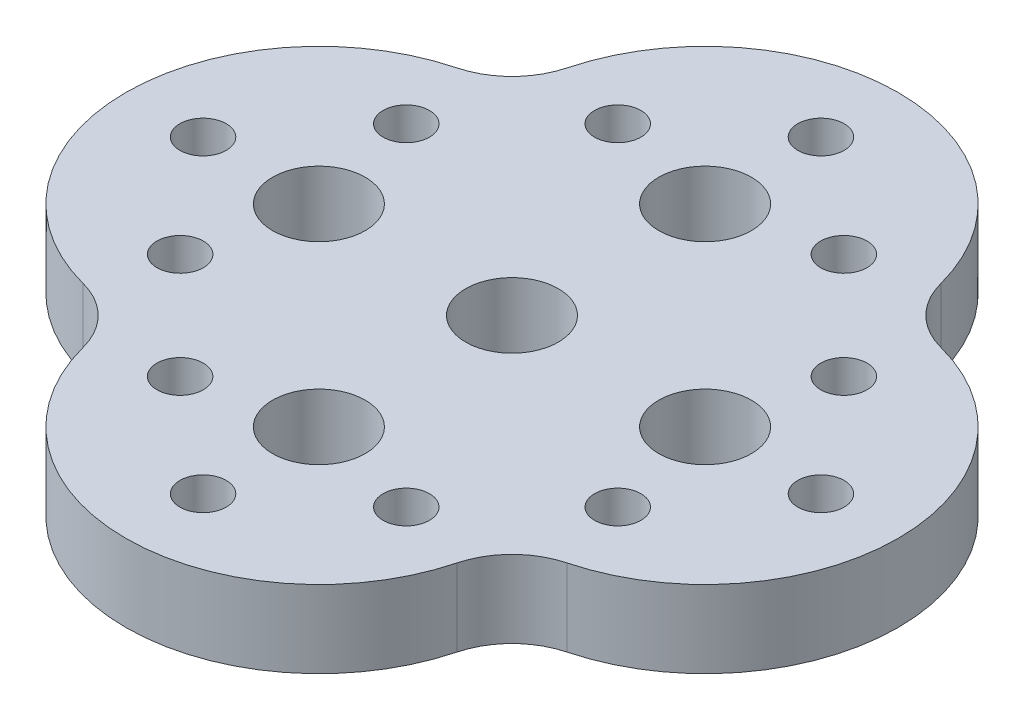
ISO-10303-21;
HEADER;
FILE_DESCRIPTION(('STEP AP214'),'2;1');
FILE_NAME('part.step','',(''),(''),'','','');
FILE_SCHEMA(('AUTOMOTIVE_DESIGN { 1 0 10303 214 1 1 1 1 }'));
ENDSEC;
DATA;
#1=APPLICATION_CONTEXT('core data for automotive mechanical design processes');
#2=APPLICATION_PROTOCOL_DEFINITION('international standard','automotive_design',2000,#1);
#3=PRODUCT_CONTEXT('',#1,'mechanical');
#4=PRODUCT('Part','Part','',(#3));
#5=PRODUCT_RELATED_PRODUCT_CATEGORY('part','',(#4));
#6=PRODUCT_DEFINITION_FORMATION('','',#4);
#7=PRODUCT_DEFINITION_CONTEXT('part definition',#1,'design');
#8=PRODUCT_DEFINITION('design','',#6,#7);
#9=PRODUCT_DEFINITION_SHAPE('','',#8);
#10=(LENGTH_UNIT() NAMED_UNIT(*) SI_UNIT(.MILLI.,.METRE.));
#11=(NAMED_UNIT(*) PLANE_ANGLE_UNIT() SI_UNIT($,.RADIAN.));
#12=(NAMED_UNIT(*) SI_UNIT($,.STERADIAN.) SOLID_ANGLE_UNIT());
#13=UNCERTAINTY_MEASURE_WITH_UNIT(LENGTH_MEASURE(1.E-05),#10,'distance_accuracy_value','');
#14=(GEOMETRIC_REPRESENTATION_CONTEXT(3) GLOBAL_UNCERTAINTY_ASSIGNED_CONTEXT((#13)) GLOBAL_UNIT_ASSIGNED_CONTEXT((#10,
#11,#12)) REPRESENTATION_CONTEXT('',''));
#15=CARTESIAN_POINT('',(0.,0.,0.));
#16=DIRECTION('',(0.,0.,1.));
#17=DIRECTION('',(1.,0.,0.));
#18=AXIS2_PLACEMENT_3D('',#15,#16,#17);
#19=CARTESIAN_POINT('',(429.653560967614,254.,747.116705177323));
#20=DIRECTION('',(0.,1.,0.));
#21=DIRECTION('',(0.,0.,1.));
#22=AXIS2_PLACEMENT_3D('',#19,#20,#21);
#23=PLANE('',#22);
#24=CARTESIAN_POINT('',(719.193799483631,254.000000000002,371.449474263436));
#25=DIRECTION('',(0.,1.,0.));
#26=DIRECTION('',(0.276539134643967,0.,0.961002657129712));
#27=AXIS2_PLACEMENT_3D('',#24,#25,#26);
#28=CIRCLE('',#27,76.2);
#29=CARTESIAN_POINT('',(740.266081543502,254.000000000002,444.67787673672));
#30=VERTEX_POINT('',#29);
#31=EDGE_CURVE('E354',#30,#30,#28,.T.);
#32=ORIENTED_EDGE('',*,*,#31,.F.);
#33=EDGE_LOOP('',(#32));
#34=FACE_BOUND('',#33,.T.);
#35=CARTESIAN_POINT('',(1015.63144205464,254.000000000002,-0.405413748390896));
#36=DIRECTION('',(0.,1.,0.));
#37=DIRECTION('',(1.,0.,-1.85470023735373E-12));
#38=AXIS2_PLACEMENT_3D('',#35,#36,#37);
#39=CIRCLE('',#38,76.2);
#40=CARTESIAN_POINT('',(1091.83144205464,254.000000000003,-0.405413748532224));
#41=VERTEX_POINT('',#40);
#42=EDGE_CURVE('E346',#41,#41,#39,.T.);
#43=ORIENTED_EDGE('',*,*,#42,.F.);
#44=EDGE_LOOP('',(#43));
#45=FACE_BOUND('',#44,.T.);
#46=CARTESIAN_POINT('',(719.193799482217,254.000000000002,-372.260301759018));
#47=DIRECTION('',(0.,1.,0.));
#48=DIRECTION('',(0.27653913463313,0.,-0.96100265713283));
#49=AXIS2_PLACEMENT_3D('',#46,#47,#48);
#50=CIRCLE('',#49,76.2);
#51=CARTESIAN_POINT('',(740.266081541261,254.000000000003,-445.488704232539));
#52=VERTEX_POINT('',#51);
#53=EDGE_CURVE('E338',#52,#52,#50,.T.);
#54=ORIENTED_EDGE('',*,*,#53,.F.);
#55=EDGE_LOOP('',(#54));
#56=FACE_BOUND('',#55,.T.);
#57=CARTESIAN_POINT('',(371.486330054716,254.000000000002,-719.967771172362));
#58=DIRECTION('',(0.,1.,0.));
#59=DIRECTION('',(0.961002657121579,0.,-0.276539134672229));
#60=AXIS2_PLACEMENT_3D('',#57,#58,#59);
#61=CIRCLE('',#60,76.2);
#62=CARTESIAN_POINT('',(444.714732527381,254.000000000003,-741.040053234386));
#63=VERTEX_POINT('',#62);
#64=EDGE_CURVE('E330',#63,#63,#61,.T.);
#65=ORIENTED_EDGE('',*,*,#64,.F.);
#66=EDGE_LOOP('',(#65));
#67=FACE_BOUND('',#66,.T.);
#68=CARTESIAN_POINT('',(-0.368557952435466,254.000000000002,-1016.40541374768));
#69=DIRECTION('',(0.,1.,0.));
#70=DIRECTION('',(0.,0.,-1.));
#71=AXIS2_PLACEMENT_3D('',#68,#69,#70);
#72=CIRCLE('',#71,76.2);
#73=CARTESIAN_POINT('',(-0.368557952434393,254.000000000003,-1092.60541374768));
#74=VERTEX_POINT('',#73);
#75=EDGE_CURVE('E322',#74,#74,#72,.T.);
#76=ORIENTED_EDGE('',*,*,#75,.F.);
#77=EDGE_LOOP('',(#76));
#78=FACE_BOUND('',#77,.T.);
#79=CARTESIAN_POINT('',(-372.223445959588,254.000000000002,-719.967771172363));
#80=DIRECTION('',(0.,1.,0.));
#81=DIRECTION('',(-0.961002657121577,0.,-0.276539134672236));
#82=AXIS2_PLACEMENT_3D('',#79,#80,#81);
#83=CIRCLE('',#82,76.2);
#84=CARTESIAN_POINT('',(-445.451848432252,254.000000000003,-741.040053234388));
#85=VERTEX_POINT('',#84);
#86=EDGE_CURVE('E314',#85,#85,#83,.T.);
#87=ORIENTED_EDGE('',*,*,#86,.F.);
#88=EDGE_LOOP('',(#87));
#89=FACE_BOUND('',#88,.T.);
#90=CARTESIAN_POINT('',(-719.930915387087,254.000000000002,-372.260301759017));
#91=DIRECTION('',(0.,1.,0.));
#92=DIRECTION('',(-0.276539134633121,0.,-0.961002657132833));
#93=AXIS2_PLACEMENT_3D('',#90,#91,#92);
#94=CIRCLE('',#93,76.2);
#95=CARTESIAN_POINT('',(-741.003197446131,254.000000000003,-445.488704232539));
#96=VERTEX_POINT('',#95);
#97=EDGE_CURVE('E306',#96,#96,#94,.T.);
#98=ORIENTED_EDGE('',*,*,#97,.F.);
#99=EDGE_LOOP('',(#98));
#100=FACE_BOUND('',#99,.T.);
#101=CARTESIAN_POINT('',(-1016.36855795951,254.000000000002,-0.405413748391502));
#102=DIRECTION('',(0.,1.,0.));
#103=DIRECTION('',(-1.,0.,-1.86800002889433E-12));
#104=AXIS2_PLACEMENT_3D('',#101,#102,#103);
#105=CIRCLE('',#104,76.2);
#106=CARTESIAN_POINT('',(-1092.56855795951,254.000000000003,-0.405413748533843));
#107=VERTEX_POINT('',#106);
#108=EDGE_CURVE('E297',#107,#107,#105,.T.);
#109=ORIENTED_EDGE('',*,*,#108,.F.);
#110=EDGE_LOOP('',(#109));
#111=FACE_BOUND('',#110,.T.);
#112=CARTESIAN_POINT('',(-719.930915388502,254.000000000002,371.449474263436));
#113=DIRECTION('',(0.,1.,0.));
#114=DIRECTION('',(-0.276539134643981,0.,0.961002657129708));
#115=AXIS2_PLACEMENT_3D('',#112,#113,#114);
#116=CIRCLE('',#115,76.2);
#117=CARTESIAN_POINT('',(-741.003197448373,254.000000000002,444.67787673672));
#118=VERTEX_POINT('',#117);
#119=EDGE_CURVE('E369',#118,#118,#116,.T.);
#120=ORIENTED_EDGE('',*,*,#119,.F.);
#121=EDGE_LOOP('',(#120));
#122=FACE_BOUND('',#121,.T.);
#123=CARTESIAN_POINT('',(-372.223445959759,254.000000000002,719.156943677051));
#124=DIRECTION('',(0.,1.,0.));
#125=DIRECTION('',(-0.961002657117675,0.,0.276539134685794));
#126=AXIS2_PLACEMENT_3D('',#123,#124,#125);
#127=CIRCLE('',#126,76.2);
#128=CARTESIAN_POINT('',(-445.451848432126,254.000000000003,740.229225740108));
#129=VERTEX_POINT('',#128);
#130=EDGE_CURVE('E361',#129,#129,#127,.T.);
#131=ORIENTED_EDGE('',*,*,#130,.F.);
#132=EDGE_LOOP('',(#131));
#133=FACE_BOUND('',#132,.T.);
#134=CARTESIAN_POINT('',(371.486330054887,254.000000000002,719.156943677051));
#135=DIRECTION('',(0.,1.,0.));
#136=DIRECTION('',(0.961002657117672,0.,0.276539134685807));
#137=AXIS2_PLACEMENT_3D('',#134,#135,#136);
#138=CIRCLE('',#137,76.2);
#139=CARTESIAN_POINT('',(444.714732527254,254.000000000003,740.22922574011));
#140=VERTEX_POINT('',#139);
#141=EDGE_CURVE('E289',#140,#140,#138,.T.);
#142=ORIENTED_EDGE('',*,*,#141,.F.);
#143=EDGE_LOOP('',(#142));
#144=FACE_BOUND('',#143,.T.);
#145=CARTESIAN_POINT('',(-0.36855795243626,254.,1015.59458625232));
#146=DIRECTION('',(0.,1.,0.));
#147=DIRECTION('',(0.,0.,1.));
#148=AXIS2_PLACEMENT_3D('',#145,#146,#147);
#149=CIRCLE('',#148,76.2);
#150=CARTESIAN_POINT('',(-0.36855795243626,254.,1091.79458625232));
#151=VERTEX_POINT('',#150);
#152=EDGE_CURVE('E281',#151,#151,#149,.T.);
#153=ORIENTED_EDGE('',*,*,#152,.F.);
#154=EDGE_LOOP('',(#153));
#155=FACE_BOUND('',#154,.T.);
#156=CARTESIAN_POINT('',(-0.368557952435851,254.,634.59458625232));
#157=DIRECTION('',(0.,1.,0.));
#158=DIRECTION('',(0.,0.,1.));
#159=AXIS2_PLACEMENT_3D('',#156,#157,#158);
#160=CIRCLE('',#159,152.4);
#161=CARTESIAN_POINT('',(-0.368557952435851,254.,786.99458625232));
#162=VERTEX_POINT('',#161);
#163=EDGE_CURVE('E261',#162,#162,#160,.T.);
#164=ORIENTED_EDGE('',*,*,#163,.F.);
#165=EDGE_LOOP('',(#164));
#166=FACE_BOUND('',#165,.T.);
#167=CARTESIAN_POINT('',(-0.368557952435851,254.,-635.405413747679));
#168=DIRECTION('',(0.,1.,0.));
#169=DIRECTION('',(0.,0.,1.));
#170=AXIS2_PLACEMENT_3D('',#167,#168,#169);
#171=CIRCLE('',#170,152.4);
#172=CARTESIAN_POINT('',(-0.368557952435851,254.,-483.005413747679));
#173=VERTEX_POINT('',#172);
#174=EDGE_CURVE('E245',#173,#173,#171,.T.);
#175=ORIENTED_EDGE('',*,*,#174,.F.);
#176=EDGE_LOOP('',(#175));
#177=FACE_BOUND('',#176,.T.);
#178=CARTESIAN_POINT('',(859.675679887664,254.,859.638824102326));
#179=DIRECTION('',(0.,-1.,0.));
#180=DIRECTION('',(0.,0.,1.));
#181=AXIS2_PLACEMENT_3D('',#178,#179,#180);
#182=CIRCLE('',#181,254.000000017688);
#183=CARTESIAN_POINT('',(613.94875477827,254.,795.340470427697));
#184=VERTEX_POINT('',#183);
#185=CARTESIAN_POINT('',(795.377326216378,254.,613.911898992058));
#186=VERTEX_POINT('',#185);
#187=EDGE_CURVE('E196',#184,#186,#182,.T.);
#188=ORIENTED_EDGE('',*,*,#187,.T.);
#189=CARTESIAN_POINT('',(634.631442047564,254.,-0.405413747679431));
#190=DIRECTION('',(0.,1.,0.));
#191=DIRECTION('',(0.,0.,1.));
#192=AXIS2_PLACEMENT_3D('',#189,#190,#191);
#193=CIRCLE('',#192,635.000000007075);
#194=CARTESIAN_POINT('',(795.377326211212,254.,-614.722726488768));
#195=VERTEX_POINT('',#194);
#196=EDGE_CURVE('E132',#186,#195,#193,.T.);
#197=ORIENTED_EDGE('',*,*,#196,.T.);
#198=CARTESIAN_POINT('',(859.675679877199,254.,-860.449651587219));
#199=DIRECTION('',(0.,-1.,0.));
#200=DIRECTION('',(0.,0.,1.));
#201=AXIS2_PLACEMENT_3D('',#198,#199,#200);
#202=CIRCLE('',#201,254.000000004914);
#203=CARTESIAN_POINT('',(613.948754779622,254.,-796.151297917891));
#204=VERTEX_POINT('',#203);
#205=EDGE_CURVE('E217',#195,#204,#202,.T.);
#206=ORIENTED_EDGE('',*,*,#205,.T.);
#207=CARTESIAN_POINT('',(-0.368557952435851,254.,-635.405413747679));
#208=DIRECTION('',(0.,1.,0.));
#209=DIRECTION('',(0.,0.,1.));
#210=AXIS2_PLACEMENT_3D('',#207,#208,#209);
#211=CIRCLE('',#210,635.);
#212=CARTESIAN_POINT('',(-614.685870684494,254.,-796.15129791789));
#213=VERTEX_POINT('',#212);
#214=EDGE_CURVE('E231',#204,#213,#211,.T.);
#215=ORIENTED_EDGE('',*,*,#214,.T.);
#216=CARTESIAN_POINT('',(-860.412795782071,254.,-860.449651587218));
#217=DIRECTION('',(0.,-1.,0.));
#218=DIRECTION('',(0.,0.,-1.));
#219=AXIS2_PLACEMENT_3D('',#216,#217,#218);
#220=CIRCLE('',#219,254.000000004914);
#221=CARTESIAN_POINT('',(-796.114442116084,254.,-614.722726488767));
#222=VERTEX_POINT('',#221);
#223=EDGE_CURVE('E151',#213,#222,#220,.T.);
#224=ORIENTED_EDGE('',*,*,#223,.T.);
#225=CARTESIAN_POINT('',(-635.368557952436,254.,-0.405413747679431));
#226=DIRECTION('',(0.,1.,0.));
#227=DIRECTION('',(0.,0.,1.));
#228=AXIS2_PLACEMENT_3D('',#225,#226,#227);
#229=CIRCLE('',#228,635.000000007074);
#230=CARTESIAN_POINT('',(-796.114442121249,254.,613.911898992057));
#231=VERTEX_POINT('',#230);
#232=EDGE_CURVE('E145',#222,#231,#229,.T.);
#233=ORIENTED_EDGE('',*,*,#232,.T.);
#234=CARTESIAN_POINT('',(-860.412795792536,254.,859.638824102325));
#235=DIRECTION('',(0.,-1.,0.));
#236=DIRECTION('',(0.,0.,-1.));
#237=AXIS2_PLACEMENT_3D('',#234,#235,#236);
#238=CIRCLE('',#237,254.000000017687);
#239=CARTESIAN_POINT('',(-614.685870683142,254.,795.340470427697));
#240=VERTEX_POINT('',#239);
#241=EDGE_CURVE('E149',#231,#240,#238,.T.);
#242=ORIENTED_EDGE('',*,*,#241,.T.);
#243=CARTESIAN_POINT('',(-0.368557952435851,254.,634.59458625232));
#244=DIRECTION('',(0.,1.,0.));
#245=DIRECTION('',(0.,0.,1.));
#246=AXIS2_PLACEMENT_3D('',#243,#244,#245);
#247=CIRCLE('',#246,635.);
#248=EDGE_CURVE('E89',#240,#184,#247,.T.);
#249=ORIENTED_EDGE('',*,*,#248,.T.);
#250=EDGE_LOOP('',(#188,#197,#206,#215,#224,#233,#242,#249));
#251=FACE_BOUND('',#250,.T.);
#252=CARTESIAN_POINT('',(-0.368557952435851,254.,-0.405413747679431));
#253=DIRECTION('',(0.,1.,0.));
#254=DIRECTION('',(0.,0.,1.));
#255=AXIS2_PLACEMENT_3D('',#252,#253,#254);
#256=CIRCLE('',#255,152.4);
#257=CARTESIAN_POINT('',(-0.368557952435851,254.,151.994586252321));
#258=VERTEX_POINT('',#257);
#259=EDGE_CURVE('E178',#258,#258,#256,.T.);
#260=ORIENTED_EDGE('',*,*,#259,.F.);
#261=EDGE_LOOP('',(#260));
#262=FACE_BOUND('',#261,.T.);
#263=CARTESIAN_POINT('',(634.631442047564,254.,-0.405413747679431));
#264=DIRECTION('',(0.,1.,0.));
#265=DIRECTION('',(0.,0.,1.));
#266=AXIS2_PLACEMENT_3D('',#263,#264,#265);
#267=CIRCLE('',#266,152.4);
#268=CARTESIAN_POINT('',(634.631442047564,254.,151.994586252321));
#269=VERTEX_POINT('',#268);
#270=EDGE_CURVE('E253',#269,#269,#267,.T.);
#271=ORIENTED_EDGE('',*,*,#270,.F.);
#272=EDGE_LOOP('',(#271));
#273=FACE_BOUND('',#272,.T.);
#274=CARTESIAN_POINT('',(-635.368557952436,254.,-0.405413747679431));
#275=DIRECTION('',(0.,1.,0.));
#276=DIRECTION('',(0.,0.,1.));
#277=AXIS2_PLACEMENT_3D('',#274,#275,#276);
#278=CIRCLE('',#277,152.4);
#279=CARTESIAN_POINT('',(-635.368557952436,254.,151.994586252321));
#280=VERTEX_POINT('',#279);
#281=EDGE_CURVE('E269',#280,#280,#278,.T.);
#282=ORIENTED_EDGE('',*,*,#281,.F.);
#283=EDGE_LOOP('',(#282));
#284=FACE_BOUND('',#283,.T.);
#285=ADVANCED_FACE('F71',(#34,#45,#56,#67,#78,#89,#100,#111,#122,#133,#144,#155,#166,#177,#251,
#262,#273,#284),#23,.T.);
#286=CARTESIAN_POINT('',(429.653560967614,0.,747.116705177323));
#287=DIRECTION('',(0.,1.,0.));
#288=DIRECTION('',(0.,0.,1.));
#289=AXIS2_PLACEMENT_3D('',#286,#287,#288);
#290=PLANE('',#289);
#291=CARTESIAN_POINT('',(719.193799483632,2.38697950294409E-12,371.449474263436));
#292=DIRECTION('',(0.,1.,0.));
#293=DIRECTION('',(0.276539134643967,0.,0.961002657129712));
#294=AXIS2_PLACEMENT_3D('',#291,#292,#293);
#295=CIRCLE('',#294,76.2);
#296=CARTESIAN_POINT('',(740.266081543502,2.37359524404632E-12,444.67787673672));
#297=VERTEX_POINT('',#296);
#298=EDGE_CURVE('E293',#297,#297,#295,.T.);
#299=ORIENTED_EDGE('',*,*,#298,.T.);
#300=EDGE_LOOP('',(#299));
#301=FACE_BOUND('',#300,.T.);
#302=CARTESIAN_POINT('',(1015.63144205464,2.38697950294409E-12,-0.405413748392583));
#303=DIRECTION('',(0.,1.,0.));
#304=DIRECTION('',(1.,0.,-1.85470023735373E-12));
#305=AXIS2_PLACEMENT_3D('',#302,#303,#304);
#306=CIRCLE('',#305,76.2);
#307=CARTESIAN_POINT('',(1091.83144205464,2.68317296316633E-12,-0.405413748533912));
#308=VERTEX_POINT('',#307);
#309=EDGE_CURVE('E350',#308,#308,#306,.T.);
#310=ORIENTED_EDGE('',*,*,#309,.T.);
#311=EDGE_LOOP('',(#310));
#312=FACE_BOUND('',#311,.T.);
#313=CARTESIAN_POINT('',(719.193799482216,2.38697950294409E-12,-372.26030175902));
#314=DIRECTION('',(0.,1.,0.));
#315=DIRECTION('',(0.27653913463313,0.,-0.96100265713283));
#316=AXIS2_PLACEMENT_3D('',#313,#314,#315);
#317=CIRCLE('',#316,76.2);
#318=CARTESIAN_POINT('',(740.266081541261,3.1446356092551E-12,-445.488704232542));
#319=VERTEX_POINT('',#318);
#320=EDGE_CURVE('E342',#319,#319,#317,.T.);
#321=ORIENTED_EDGE('',*,*,#320,.T.);
#322=EDGE_LOOP('',(#321));
#323=FACE_BOUND('',#322,.T.);
#324=CARTESIAN_POINT('',(371.486330054717,2.38697950294409E-12,-719.967771172364));
#325=DIRECTION('',(0.,1.,0.));
#326=DIRECTION('',(0.961002657121579,0.,-0.276539134672229));
#327=AXIS2_PLACEMENT_3D('',#324,#325,#326);
#328=CIRCLE('',#327,76.2);
#329=CARTESIAN_POINT('',(444.714732527381,2.79820424904583E-12,-741.040053234388));
#330=VERTEX_POINT('',#329);
#331=EDGE_CURVE('E334',#330,#330,#328,.T.);
#332=ORIENTED_EDGE('',*,*,#331,.T.);
#333=EDGE_LOOP('',(#332));
#334=FACE_BOUND('',#333,.T.);
#335=CARTESIAN_POINT('',(-0.368557952436166,2.38697950294409E-12,-1016.40541374768));
#336=DIRECTION('',(0.,1.,0.));
#337=DIRECTION('',(0.,0.,-1.));
#338=AXIS2_PLACEMENT_3D('',#335,#336,#337);
#339=CIRCLE('',#338,76.2);
#340=CARTESIAN_POINT('',(-0.368557952435092,3.18930856986811E-12,-1092.60541374768));
#341=VERTEX_POINT('',#340);
#342=EDGE_CURVE('E326',#341,#341,#339,.T.);
#343=ORIENTED_EDGE('',*,*,#342,.T.);
#344=EDGE_LOOP('',(#343));
#345=FACE_BOUND('',#344,.T.);
#346=CARTESIAN_POINT('',(-372.22344595959,2.38697950294409E-12,-719.967771172365));
#347=DIRECTION('',(0.,1.,0.));
#348=DIRECTION('',(-0.961002657121577,0.,-0.276539134672236));
#349=AXIS2_PLACEMENT_3D('',#346,#347,#348);
#350=CIRCLE('',#349,76.2);
#351=CARTESIAN_POINT('',(-445.451848432254,2.99995920965592E-12,-741.040053234389));
#352=VERTEX_POINT('',#351);
#353=EDGE_CURVE('E318',#352,#352,#350,.T.);
#354=ORIENTED_EDGE('',*,*,#353,.T.);
#355=EDGE_LOOP('',(#354));
#356=FACE_BOUND('',#355,.T.);
#357=CARTESIAN_POINT('',(-719.930915387088,2.38697950294409E-12,-372.26030175902));
#358=DIRECTION('',(0.,1.,0.));
#359=DIRECTION('',(-0.276539134633121,0.,-0.961002657132833));
#360=AXIS2_PLACEMENT_3D('',#357,#358,#359);
#361=CIRCLE('',#360,76.2);
#362=CARTESIAN_POINT('',(-741.003197446132,3.20269282876599E-12,-445.488704232542));
#363=VERTEX_POINT('',#362);
#364=EDGE_CURVE('E310',#363,#363,#361,.T.);
#365=ORIENTED_EDGE('',*,*,#364,.T.);
#366=EDGE_LOOP('',(#365));
#367=FACE_BOUND('',#366,.T.);
#368=CARTESIAN_POINT('',(-1016.36855795951,2.38697950294409E-12,-0.405413748392489));
#369=DIRECTION('',(0.,1.,0.));
#370=DIRECTION('',(-1.,0.,-1.86800002889433E-12));
#371=AXIS2_PLACEMENT_3D('',#368,#369,#370);
#372=CIRCLE('',#371,76.2);
#373=CARTESIAN_POINT('',(-1092.56855795951,2.89311510964737E-12,-0.40541374853483));
#374=VERTEX_POINT('',#373);
#375=EDGE_CURVE('E301',#374,#374,#372,.T.);
#376=ORIENTED_EDGE('',*,*,#375,.T.);
#377=EDGE_LOOP('',(#376));
#378=FACE_BOUND('',#377,.T.);
#379=CARTESIAN_POINT('',(-719.930915388502,2.38697950294409E-12,371.449474263436));
#380=DIRECTION('',(0.,1.,0.));
#381=DIRECTION('',(-0.276539134643981,0.,0.961002657129708));
#382=AXIS2_PLACEMENT_3D('',#379,#380,#381);
#383=CIRCLE('',#382,76.2);
#384=CARTESIAN_POINT('',(-741.003197448374,2.43165246355949E-12,444.67787673672));
#385=VERTEX_POINT('',#384);
#386=EDGE_CURVE('E302',#385,#385,#383,.T.);
#387=ORIENTED_EDGE('',*,*,#386,.T.);
#388=EDGE_LOOP('',(#387));
#389=FACE_BOUND('',#388,.T.);
#390=CARTESIAN_POINT('',(-372.223445959761,2.38697950294409E-12,719.15694367705));
#391=DIRECTION('',(0.,1.,0.));
#392=DIRECTION('',(-0.961002657117675,0.,0.276539134685794));
#393=AXIS2_PLACEMENT_3D('',#390,#391,#392);
#394=CIRCLE('',#393,76.2);
#395=CARTESIAN_POINT('',(-445.451848432128,2.77808382376052E-12,740.229225740107));
#396=VERTEX_POINT('',#395);
#397=EDGE_CURVE('E365',#396,#396,#394,.T.);
#398=ORIENTED_EDGE('',*,*,#397,.T.);
#399=EDGE_LOOP('',(#398));
#400=FACE_BOUND('',#399,.T.);
#401=CARTESIAN_POINT('',(371.486330054888,2.38697950294409E-12,719.15694367705));
#402=DIRECTION('',(0.,1.,0.));
#403=DIRECTION('',(0.961002657117672,0.,0.276539134685807));
#404=AXIS2_PLACEMENT_3D('',#401,#402,#403);
#405=CIRCLE('',#404,76.2);
#406=CARTESIAN_POINT('',(444.714732527255,2.57632886315125E-12,740.229225740108));
#407=VERTEX_POINT('',#406);
#408=EDGE_CURVE('E285',#407,#407,#405,.T.);
#409=ORIENTED_EDGE('',*,*,#408,.T.);
#410=EDGE_LOOP('',(#409));
#411=FACE_BOUND('',#410,.T.);
#412=CARTESIAN_POINT('',(-0.36855795243626,0.,1015.59458625232));
#413=DIRECTION('',(0.,1.,0.));
#414=DIRECTION('',(0.,0.,1.));
#415=AXIS2_PLACEMENT_3D('',#412,#413,#414);
#416=CIRCLE('',#415,76.2);
#417=CARTESIAN_POINT('',(-0.36855795243626,0.,1091.79458625232));
#418=VERTEX_POINT('',#417);
#419=EDGE_CURVE('E277',#418,#418,#416,.T.);
#420=ORIENTED_EDGE('',*,*,#419,.T.);
#421=EDGE_LOOP('',(#420));
#422=FACE_BOUND('',#421,.T.);
#423=CARTESIAN_POINT('',(859.675679887664,0.,859.638824102326));
#424=DIRECTION('',(0.,-1.,0.));
#425=DIRECTION('',(0.,0.,1.));
#426=AXIS2_PLACEMENT_3D('',#423,#424,#425);
#427=CIRCLE('',#426,254.000000017688);
#428=CARTESIAN_POINT('',(613.94875477827,0.,795.340470427697));
#429=VERTEX_POINT('',#428);
#430=CARTESIAN_POINT('',(795.377326216378,0.,613.911898992058));
#431=VERTEX_POINT('',#430);
#432=EDGE_CURVE('E173',#429,#431,#427,.T.);
#433=ORIENTED_EDGE('',*,*,#432,.F.);
#434=CARTESIAN_POINT('',(-0.368557952435851,0.,634.59458625232));
#435=DIRECTION('',(0.,1.,0.));
#436=DIRECTION('',(0.,0.,1.));
#437=AXIS2_PLACEMENT_3D('',#434,#435,#436);
#438=CIRCLE('',#437,635.);
#439=CARTESIAN_POINT('',(-614.685870683142,0.,795.340470427697));
#440=VERTEX_POINT('',#439);
#441=EDGE_CURVE('E124',#440,#429,#438,.T.);
#442=ORIENTED_EDGE('',*,*,#441,.F.);
#443=CARTESIAN_POINT('',(-860.412795792536,0.,859.638824102325));
#444=DIRECTION('',(0.,-1.,0.));
#445=DIRECTION('',(0.,0.,-1.));
#446=AXIS2_PLACEMENT_3D('',#443,#444,#445);
#447=CIRCLE('',#446,254.000000017687);
#448=CARTESIAN_POINT('',(-796.114442121249,0.,613.911898992057));
#449=VERTEX_POINT('',#448);
#450=EDGE_CURVE('E118',#449,#440,#447,.T.);
#451=ORIENTED_EDGE('',*,*,#450,.F.);
#452=CARTESIAN_POINT('',(-635.368557952436,0.,-0.405413747679431));
#453=DIRECTION('',(0.,1.,0.));
#454=DIRECTION('',(0.,0.,1.));
#455=AXIS2_PLACEMENT_3D('',#452,#453,#454);
#456=CIRCLE('',#455,635.000000007074);
#457=CARTESIAN_POINT('',(-796.114442116084,0.,-614.722726488767));
#458=VERTEX_POINT('',#457);
#459=EDGE_CURVE('E160',#458,#449,#456,.T.);
#460=ORIENTED_EDGE('',*,*,#459,.F.);
#461=CARTESIAN_POINT('',(-860.412795782071,0.,-860.449651587218));
#462=DIRECTION('',(0.,-1.,0.));
#463=DIRECTION('',(0.,0.,-1.));
#464=AXIS2_PLACEMENT_3D('',#461,#462,#463);
#465=CIRCLE('',#464,254.000000004914);
#466=CARTESIAN_POINT('',(-614.685870684494,0.,-796.15129791789));
#467=VERTEX_POINT('',#466);
#468=EDGE_CURVE('E187',#467,#458,#465,.T.);
#469=ORIENTED_EDGE('',*,*,#468,.F.);
#470=CARTESIAN_POINT('',(-0.368557952435851,0.,-635.405413747679));
#471=DIRECTION('',(0.,1.,0.));
#472=DIRECTION('',(0.,0.,1.));
#473=AXIS2_PLACEMENT_3D('',#470,#471,#472);
#474=CIRCLE('',#473,635.);
#475=CARTESIAN_POINT('',(613.948754779622,0.,-796.151297917891));
#476=VERTEX_POINT('',#475);
#477=EDGE_CURVE('E184',#476,#467,#474,.T.);
#478=ORIENTED_EDGE('',*,*,#477,.F.);
#479=CARTESIAN_POINT('',(859.675679877199,0.,-860.449651587219));
#480=DIRECTION('',(0.,-1.,0.));
#481=DIRECTION('',(0.,0.,1.));
#482=AXIS2_PLACEMENT_3D('',#479,#480,#481);
#483=CIRCLE('',#482,254.000000004914);
#484=CARTESIAN_POINT('',(795.377326211212,0.,-614.722726488768));
#485=VERTEX_POINT('',#484);
#486=EDGE_CURVE('E181',#485,#476,#483,.T.);
#487=ORIENTED_EDGE('',*,*,#486,.F.);
#488=CARTESIAN_POINT('',(634.631442047564,0.,-0.405413747679431));
#489=DIRECTION('',(0.,1.,0.));
#490=DIRECTION('',(0.,0.,1.));
#491=AXIS2_PLACEMENT_3D('',#488,#489,#490);
#492=CIRCLE('',#491,635.000000007075);
#493=EDGE_CURVE('E177',#431,#485,#492,.T.);
#494=ORIENTED_EDGE('',*,*,#493,.F.);
#495=EDGE_LOOP('',(#433,#442,#451,#460,#469,#478,#487,#494));
#496=FACE_BOUND('',#495,.T.);
#497=CARTESIAN_POINT('',(-0.368557952435851,0.,-0.405413747679431));
#498=DIRECTION('',(0.,1.,0.));
#499=DIRECTION('',(0.,0.,1.));
#500=AXIS2_PLACEMENT_3D('',#497,#498,#499);
#501=CIRCLE('',#500,152.4);
#502=CARTESIAN_POINT('',(-0.368557952435851,0.,151.994586252321));
#503=VERTEX_POINT('',#502);
#504=EDGE_CURVE('E241',#503,#503,#501,.T.);
#505=ORIENTED_EDGE('',*,*,#504,.T.);
#506=EDGE_LOOP('',(#505));
#507=FACE_BOUND('',#506,.T.);
#508=CARTESIAN_POINT('',(-0.368557952435851,0.,-635.405413747679));
#509=DIRECTION('',(0.,1.,0.));
#510=DIRECTION('',(0.,0.,1.));
#511=AXIS2_PLACEMENT_3D('',#508,#509,#510);
#512=CIRCLE('',#511,152.4);
#513=CARTESIAN_POINT('',(-0.368557952435851,0.,-483.005413747679));
#514=VERTEX_POINT('',#513);
#515=EDGE_CURVE('E249',#514,#514,#512,.T.);
#516=ORIENTED_EDGE('',*,*,#515,.T.);
#517=EDGE_LOOP('',(#516));
#518=FACE_BOUND('',#517,.T.);
#519=CARTESIAN_POINT('',(634.631442047564,0.,-0.405413747679431));
#520=DIRECTION('',(0.,1.,0.));
#521=DIRECTION('',(0.,0.,1.));
#522=AXIS2_PLACEMENT_3D('',#519,#520,#521);
#523=CIRCLE('',#522,152.4);
#524=CARTESIAN_POINT('',(634.631442047564,0.,151.994586252321));
#525=VERTEX_POINT('',#524);
#526=EDGE_CURVE('E257',#525,#525,#523,.T.);
#527=ORIENTED_EDGE('',*,*,#526,.T.);
#528=EDGE_LOOP('',(#527));
#529=FACE_BOUND('',#528,.T.);
#530=CARTESIAN_POINT('',(-0.368557952435851,0.,634.59458625232));
#531=DIRECTION('',(0.,1.,0.));
#532=DIRECTION('',(0.,0.,1.));
#533=AXIS2_PLACEMENT_3D('',#530,#531,#532);
#534=CIRCLE('',#533,152.4);
#535=CARTESIAN_POINT('',(-0.368557952435851,0.,786.99458625232));
#536=VERTEX_POINT('',#535);
#537=EDGE_CURVE('E265',#536,#536,#534,.T.);
#538=ORIENTED_EDGE('',*,*,#537,.T.);
#539=EDGE_LOOP('',(#538));
#540=FACE_BOUND('',#539,.T.);
#541=CARTESIAN_POINT('',(-635.368557952436,0.,-0.405413747679431));
#542=DIRECTION('',(0.,1.,0.));
#543=DIRECTION('',(0.,0.,1.));
#544=AXIS2_PLACEMENT_3D('',#541,#542,#543);
#545=CIRCLE('',#544,152.4);
#546=CARTESIAN_POINT('',(-635.368557952436,0.,151.994586252321));
#547=VERTEX_POINT('',#546);
#548=EDGE_CURVE('E273',#547,#547,#545,.T.);
#549=ORIENTED_EDGE('',*,*,#548,.T.);
#550=EDGE_LOOP('',(#549));
#551=FACE_BOUND('',#550,.T.);
#552=ADVANCED_FACE('F221',(#301,#312,#323,#334,#345,#356,#367,#378,#389,#400,#411,#422,#496,
#507,#518,#529,#540,#551),#290,.F.);
#553=CARTESIAN_POINT('',(859.675679887664,254.,859.638824102326));
#554=DIRECTION('',(0.,-1.,0.));
#555=DIRECTION('',(0.,0.,-1.));
#556=AXIS2_PLACEMENT_3D('',#553,#554,#555);
#557=CYLINDRICAL_SURFACE('',#556,254.000000017688);
#558=ORIENTED_EDGE('',*,*,#432,.T.);
#559=DIRECTION('',(0.,-1.,0.));
#560=VECTOR('',#559,1.);
#561=CARTESIAN_POINT('',(795.377326216378,254.,613.911898992058));
#562=LINE('',#561,#560);
#563=EDGE_CURVE('E13',#186,#431,#562,.T.);
#564=ORIENTED_EDGE('',*,*,#563,.F.);
#565=ORIENTED_EDGE('',*,*,#187,.F.);
#566=DIRECTION('',(0.,-1.,0.));
#567=VECTOR('',#566,1.);
#568=CARTESIAN_POINT('',(613.94875477827,254.,795.340470427697));
#569=LINE('',#568,#567);
#570=EDGE_CURVE('E169',#184,#429,#569,.T.);
#571=ORIENTED_EDGE('',*,*,#570,.T.);
#572=EDGE_LOOP('',(#558,#564,#565,#571));
#573=FACE_BOUND('',#572,.T.);
#574=ADVANCED_FACE('F73',(#573),#557,.F.);
#575=CARTESIAN_POINT('',(634.631442047564,254.,-0.405413747679431));
#576=DIRECTION('',(0.,-1.,0.));
#577=DIRECTION('',(0.,0.,-1.));
#578=AXIS2_PLACEMENT_3D('',#575,#576,#577);
#579=CYLINDRICAL_SURFACE('',#578,635.000000007075);
#580=ORIENTED_EDGE('',*,*,#493,.T.);
#581=DIRECTION('',(0.,-1.,0.));
#582=VECTOR('',#581,1.);
#583=CARTESIAN_POINT('',(795.377326211212,254.,-614.722726488768));
#584=LINE('',#583,#582);
#585=EDGE_CURVE('E81',#195,#485,#584,.T.);
#586=ORIENTED_EDGE('',*,*,#585,.F.);
#587=ORIENTED_EDGE('',*,*,#196,.F.);
#588=ORIENTED_EDGE('',*,*,#563,.T.);
#589=EDGE_LOOP('',(#580,#586,#587,#588));
#590=FACE_BOUND('',#589,.T.);
#591=ADVANCED_FACE('F454',(#590),#579,.T.);
#592=CARTESIAN_POINT('',(859.675679877199,254.,-860.449651587219));
#593=DIRECTION('',(0.,-1.,0.));
#594=DIRECTION('',(0.,0.,-1.));
#595=AXIS2_PLACEMENT_3D('',#592,#593,#594);
#596=CYLINDRICAL_SURFACE('',#595,254.000000004914);
#597=ORIENTED_EDGE('',*,*,#486,.T.);
#598=DIRECTION('',(0.,-1.,0.));
#599=VECTOR('',#598,1.);
#600=CARTESIAN_POINT('',(613.948754779622,254.,-796.151297917891));
#601=LINE('',#600,#599);
#602=EDGE_CURVE('E207',#204,#476,#601,.T.);
#603=ORIENTED_EDGE('',*,*,#602,.F.);
#604=ORIENTED_EDGE('',*,*,#205,.F.);
#605=ORIENTED_EDGE('',*,*,#585,.T.);
#606=EDGE_LOOP('',(#597,#603,#604,#605));
#607=FACE_BOUND('',#606,.T.);
#608=ADVANCED_FACE('F215',(#607),#596,.F.);
#609=CARTESIAN_POINT('',(-0.368557952435851,254.,-635.405413747679));
#610=DIRECTION('',(0.,-1.,0.));
#611=DIRECTION('',(0.,0.,-1.));
#612=AXIS2_PLACEMENT_3D('',#609,#610,#611);
#613=CYLINDRICAL_SURFACE('',#612,635.);
#614=ORIENTED_EDGE('',*,*,#477,.T.);
#615=DIRECTION('',(0.,-1.,0.));
#616=VECTOR('',#615,1.);
#617=CARTESIAN_POINT('',(-614.685870684494,254.,-796.15129791789));
#618=LINE('',#617,#616);
#619=EDGE_CURVE('E203',#213,#467,#618,.T.);
#620=ORIENTED_EDGE('',*,*,#619,.F.);
#621=ORIENTED_EDGE('',*,*,#214,.F.);
#622=ORIENTED_EDGE('',*,*,#602,.T.);
#623=EDGE_LOOP('',(#614,#620,#621,#622));
#624=FACE_BOUND('',#623,.T.);
#625=ADVANCED_FACE('F226',(#624),#613,.T.);
#626=CARTESIAN_POINT('',(-860.412795782071,254.,-860.449651587218));
#627=DIRECTION('',(0.,-1.,0.));
#628=DIRECTION('',(0.,0.,-1.));
#629=AXIS2_PLACEMENT_3D('',#626,#627,#628);
#630=CYLINDRICAL_SURFACE('',#629,254.000000004914);
#631=ORIENTED_EDGE('',*,*,#468,.T.);
#632=DIRECTION('',(0.,-1.,0.));
#633=VECTOR('',#632,1.);
#634=CARTESIAN_POINT('',(-796.114442116084,254.,-614.722726488767));
#635=LINE('',#634,#633);
#636=EDGE_CURVE('E162',#222,#458,#635,.T.);
#637=ORIENTED_EDGE('',*,*,#636,.F.);
#638=ORIENTED_EDGE('',*,*,#223,.F.);
#639=ORIENTED_EDGE('',*,*,#619,.T.);
#640=EDGE_LOOP('',(#631,#637,#638,#639));
#641=FACE_BOUND('',#640,.T.);
#642=ADVANCED_FACE('F229',(#641),#630,.F.);
#643=CARTESIAN_POINT('',(-635.368557952436,254.,-0.405413747679431));
#644=DIRECTION('',(0.,-1.,0.));
#645=DIRECTION('',(0.,0.,-1.));
#646=AXIS2_PLACEMENT_3D('',#643,#644,#645);
#647=CYLINDRICAL_SURFACE('',#646,635.000000007074);
#648=ORIENTED_EDGE('',*,*,#459,.T.);
#649=DIRECTION('',(0.,-1.,0.));
#650=VECTOR('',#649,1.);
#651=CARTESIAN_POINT('',(-796.114442121249,254.,613.911898992057));
#652=LINE('',#651,#650);
#653=EDGE_CURVE('E157',#231,#449,#652,.T.);
#654=ORIENTED_EDGE('',*,*,#653,.F.);
#655=ORIENTED_EDGE('',*,*,#232,.F.);
#656=ORIENTED_EDGE('',*,*,#636,.T.);
#657=EDGE_LOOP('',(#648,#654,#655,#656));
#658=FACE_BOUND('',#657,.T.);
#659=ADVANCED_FACE('F158',(#658),#647,.T.);
#660=CARTESIAN_POINT('',(-860.412795792536,254.,859.638824102325));
#661=DIRECTION('',(0.,-1.,0.));
#662=DIRECTION('',(0.,0.,-1.));
#663=AXIS2_PLACEMENT_3D('',#660,#661,#662);
#664=CYLINDRICAL_SURFACE('',#663,254.000000017687);
#665=ORIENTED_EDGE('',*,*,#450,.T.);
#666=DIRECTION('',(0.,-1.,0.));
#667=VECTOR('',#666,1.);
#668=CARTESIAN_POINT('',(-614.685870683142,254.,795.340470427697));
#669=LINE('',#668,#667);
#670=EDGE_CURVE('E163',#240,#440,#669,.T.);
#671=ORIENTED_EDGE('',*,*,#670,.F.);
#672=ORIENTED_EDGE('',*,*,#241,.F.);
#673=ORIENTED_EDGE('',*,*,#653,.T.);
#674=EDGE_LOOP('',(#665,#671,#672,#673));
#675=FACE_BOUND('',#674,.T.);
#676=ADVANCED_FACE('F165',(#675),#664,.F.);
#677=CARTESIAN_POINT('',(-0.368557952435851,254.,634.59458625232));
#678=DIRECTION('',(0.,-1.,0.));
#679=DIRECTION('',(0.,0.,-1.));
#680=AXIS2_PLACEMENT_3D('',#677,#678,#679);
#681=CYLINDRICAL_SURFACE('',#680,635.);
#682=ORIENTED_EDGE('',*,*,#441,.T.);
#683=ORIENTED_EDGE('',*,*,#570,.F.);
#684=ORIENTED_EDGE('',*,*,#248,.F.);
#685=ORIENTED_EDGE('',*,*,#670,.T.);
#686=EDGE_LOOP('',(#682,#683,#684,#685));
#687=FACE_BOUND('',#686,.T.);
#688=ADVANCED_FACE('F440',(#687),#681,.T.);
#689=CARTESIAN_POINT('',(-0.368557952435851,254.,-0.405413747679431));
#690=DIRECTION('',(0.,-1.,0.));
#691=DIRECTION('',(0.,0.,-1.));
#692=AXIS2_PLACEMENT_3D('',#689,#690,#691);
#693=CYLINDRICAL_SURFACE('',#692,152.4);
#694=ORIENTED_EDGE('',*,*,#259,.T.);
#695=EDGE_LOOP('',(#694));
#696=FACE_BOUND('',#695,.T.);
#697=ORIENTED_EDGE('',*,*,#504,.F.);
#698=EDGE_LOOP('',(#697));
#699=FACE_BOUND('',#698,.T.);
#700=ADVANCED_FACE('F405',(#696,#699),#693,.F.);
#701=CARTESIAN_POINT('',(-0.368557952435851,254.,-635.405413747679));
#702=DIRECTION('',(0.,-1.,0.));
#703=DIRECTION('',(0.,0.,-1.));
#704=AXIS2_PLACEMENT_3D('',#701,#702,#703);
#705=CYLINDRICAL_SURFACE('',#704,152.4);
#706=ORIENTED_EDGE('',*,*,#174,.T.);
#707=EDGE_LOOP('',(#706));
#708=FACE_BOUND('',#707,.T.);
#709=ORIENTED_EDGE('',*,*,#515,.F.);
#710=EDGE_LOOP('',(#709));
#711=FACE_BOUND('',#710,.T.);
#712=ADVANCED_FACE('F401',(#708,#711),#705,.F.);
#713=CARTESIAN_POINT('',(634.631442047564,254.,-0.405413747679431));
#714=DIRECTION('',(0.,-1.,0.));
#715=DIRECTION('',(0.,0.,-1.));
#716=AXIS2_PLACEMENT_3D('',#713,#714,#715);
#717=CYLINDRICAL_SURFACE('',#716,152.4);
#718=ORIENTED_EDGE('',*,*,#270,.T.);
#719=EDGE_LOOP('',(#718));
#720=FACE_BOUND('',#719,.T.);
#721=ORIENTED_EDGE('',*,*,#526,.F.);
#722=EDGE_LOOP('',(#721));
#723=FACE_BOUND('',#722,.T.);
#724=ADVANCED_FACE('F404',(#720,#723),#717,.F.);
#725=CARTESIAN_POINT('',(-0.368557952435851,254.,634.59458625232));
#726=DIRECTION('',(0.,-1.,0.));
#727=DIRECTION('',(0.,0.,-1.));
#728=AXIS2_PLACEMENT_3D('',#725,#726,#727);
#729=CYLINDRICAL_SURFACE('',#728,152.4);
#730=ORIENTED_EDGE('',*,*,#163,.T.);
#731=EDGE_LOOP('',(#730));
#732=FACE_BOUND('',#731,.T.);
#733=ORIENTED_EDGE('',*,*,#537,.F.);
#734=EDGE_LOOP('',(#733));
#735=FACE_BOUND('',#734,.T.);
#736=ADVANCED_FACE('F422',(#732,#735),#729,.F.);
#737=CARTESIAN_POINT('',(-635.368557952436,254.,-0.405413747679431));
#738=DIRECTION('',(0.,-1.,0.));
#739=DIRECTION('',(0.,0.,-1.));
#740=AXIS2_PLACEMENT_3D('',#737,#738,#739);
#741=CYLINDRICAL_SURFACE('',#740,152.4);
#742=ORIENTED_EDGE('',*,*,#281,.T.);
#743=EDGE_LOOP('',(#742));
#744=FACE_BOUND('',#743,.T.);
#745=ORIENTED_EDGE('',*,*,#548,.F.);
#746=EDGE_LOOP('',(#745));
#747=FACE_BOUND('',#746,.T.);
#748=ADVANCED_FACE('F419',(#744,#747),#741,.F.);
#749=CARTESIAN_POINT('',(-0.36855795243626,0.,1015.59458625232));
#750=DIRECTION('',(0.,1.,0.));
#751=DIRECTION('',(0.,0.,1.));
#752=AXIS2_PLACEMENT_3D('',#749,#750,#751);
#753=CYLINDRICAL_SURFACE('',#752,76.2);
#754=ORIENTED_EDGE('',*,*,#419,.F.);
#755=EDGE_LOOP('',(#754));
#756=FACE_BOUND('',#755,.T.);
#757=ORIENTED_EDGE('',*,*,#152,.T.);
#758=EDGE_LOOP('',(#757));
#759=FACE_BOUND('',#758,.T.);
#760=ADVANCED_FACE('F421',(#756,#759),#753,.F.);
#761=CARTESIAN_POINT('',(371.486330054888,2.38697950294409E-12,719.15694367705));
#762=DIRECTION('',(0.,1.,0.));
#763=DIRECTION('',(0.,0.,1.));
#764=AXIS2_PLACEMENT_3D('',#761,#762,#763);
#765=CYLINDRICAL_SURFACE('',#764,76.2);
#766=ORIENTED_EDGE('',*,*,#408,.F.);
#767=EDGE_LOOP('',(#766));
#768=FACE_BOUND('',#767,.T.);
#769=ORIENTED_EDGE('',*,*,#141,.T.);
#770=EDGE_LOOP('',(#769));
#771=FACE_BOUND('',#770,.T.);
#772=ADVANCED_FACE('F429',(#768,#771),#765,.F.);
#773=CARTESIAN_POINT('',(-372.223445959761,2.38697950294409E-12,719.15694367705));
#774=DIRECTION('',(0.,1.,0.));
#775=DIRECTION('',(-1.,0.,0.));
#776=AXIS2_PLACEMENT_3D('',#773,#774,#775);
#777=CYLINDRICAL_SURFACE('',#776,76.2);
#778=ORIENTED_EDGE('',*,*,#397,.F.);
#779=EDGE_LOOP('',(#778));
#780=FACE_BOUND('',#779,.T.);
#781=ORIENTED_EDGE('',*,*,#130,.T.);
#782=EDGE_LOOP('',(#781));
#783=FACE_BOUND('',#782,.T.);
#784=ADVANCED_FACE('F383',(#780,#783),#777,.F.);
#785=CARTESIAN_POINT('',(-719.930915388502,2.38697950294409E-12,371.449474263436));
#786=DIRECTION('',(0.,1.,0.));
#787=DIRECTION('',(-1.,0.,0.));
#788=AXIS2_PLACEMENT_3D('',#785,#786,#787);
#789=CYLINDRICAL_SURFACE('',#788,76.2);
#790=ORIENTED_EDGE('',*,*,#386,.F.);
#791=EDGE_LOOP('',(#790));
#792=FACE_BOUND('',#791,.T.);
#793=ORIENTED_EDGE('',*,*,#119,.T.);
#794=EDGE_LOOP('',(#793));
#795=FACE_BOUND('',#794,.T.);
#796=ADVANCED_FACE('F379',(#792,#795),#789,.F.);
#797=CARTESIAN_POINT('',(-1016.36855795951,2.38697950294409E-12,-0.405413748392489));
#798=DIRECTION('',(0.,1.,0.));
#799=DIRECTION('',(-1.,0.,0.));
#800=AXIS2_PLACEMENT_3D('',#797,#798,#799);
#801=CYLINDRICAL_SURFACE('',#800,76.2);
#802=ORIENTED_EDGE('',*,*,#375,.F.);
#803=EDGE_LOOP('',(#802));
#804=FACE_BOUND('',#803,.T.);
#805=ORIENTED_EDGE('',*,*,#108,.T.);
#806=EDGE_LOOP('',(#805));
#807=FACE_BOUND('',#806,.T.);
#808=ADVANCED_FACE('F382',(#804,#807),#801,.F.);
#809=CARTESIAN_POINT('',(-719.930915387088,2.38697950294409E-12,-372.26030175902));
#810=DIRECTION('',(0.,1.,0.));
#811=DIRECTION('',(0.,0.,1.));
#812=AXIS2_PLACEMENT_3D('',#809,#810,#811);
#813=CYLINDRICAL_SURFACE('',#812,76.2);
#814=ORIENTED_EDGE('',*,*,#364,.F.);
#815=EDGE_LOOP('',(#814));
#816=FACE_BOUND('',#815,.T.);
#817=ORIENTED_EDGE('',*,*,#97,.T.);
#818=EDGE_LOOP('',(#817));
#819=FACE_BOUND('',#818,.T.);
#820=ADVANCED_FACE('F575',(#816,#819),#813,.F.);
#821=CARTESIAN_POINT('',(-372.22344595959,2.38697950294409E-12,-719.967771172365));
#822=DIRECTION('',(0.,1.,0.));
#823=DIRECTION('',(-1.,0.,0.));
#824=AXIS2_PLACEMENT_3D('',#821,#822,#823);
#825=CYLINDRICAL_SURFACE('',#824,76.2);
#826=ORIENTED_EDGE('',*,*,#353,.F.);
#827=EDGE_LOOP('',(#826));
#828=FACE_BOUND('',#827,.T.);
#829=ORIENTED_EDGE('',*,*,#86,.T.);
#830=EDGE_LOOP('',(#829));
#831=FACE_BOUND('',#830,.T.);
#832=ADVANCED_FACE('F583',(#828,#831),#825,.F.);
#833=CARTESIAN_POINT('',(-0.368557952436166,2.38697950294409E-12,-1016.40541374768));
#834=DIRECTION('',(0.,1.,0.));
#835=DIRECTION('',(0.,0.,1.));
#836=AXIS2_PLACEMENT_3D('',#833,#834,#835);
#837=CYLINDRICAL_SURFACE('',#836,76.2);
#838=ORIENTED_EDGE('',*,*,#342,.F.);
#839=EDGE_LOOP('',(#838));
#840=FACE_BOUND('',#839,.T.);
#841=ORIENTED_EDGE('',*,*,#75,.T.);
#842=EDGE_LOOP('',(#841));
#843=FACE_BOUND('',#842,.T.);
#844=ADVANCED_FACE('F591',(#840,#843),#837,.F.);
#845=CARTESIAN_POINT('',(371.486330054717,2.38697950294409E-12,-719.967771172364));
#846=DIRECTION('',(0.,1.,0.));
#847=DIRECTION('',(0.,0.,1.));
#848=AXIS2_PLACEMENT_3D('',#845,#846,#847);
#849=CYLINDRICAL_SURFACE('',#848,76.2);
#850=ORIENTED_EDGE('',*,*,#331,.F.);
#851=EDGE_LOOP('',(#850));
#852=FACE_BOUND('',#851,.T.);
#853=ORIENTED_EDGE('',*,*,#64,.T.);
#854=EDGE_LOOP('',(#853));
#855=FACE_BOUND('',#854,.T.);
#856=ADVANCED_FACE('F599',(#852,#855),#849,.F.);
#857=CARTESIAN_POINT('',(719.193799482216,2.38697950294409E-12,-372.26030175902));
#858=DIRECTION('',(0.,1.,0.));
#859=DIRECTION('',(0.,0.,1.));
#860=AXIS2_PLACEMENT_3D('',#857,#858,#859);
#861=CYLINDRICAL_SURFACE('',#860,76.2);
#862=ORIENTED_EDGE('',*,*,#320,.F.);
#863=EDGE_LOOP('',(#862));
#864=FACE_BOUND('',#863,.T.);
#865=ORIENTED_EDGE('',*,*,#53,.T.);
#866=EDGE_LOOP('',(#865));
#867=FACE_BOUND('',#866,.T.);
#868=ADVANCED_FACE('F607',(#864,#867),#861,.F.);
#869=CARTESIAN_POINT('',(1015.63144205464,2.38697950294409E-12,-0.405413748392583));
#870=DIRECTION('',(0.,1.,0.));
#871=DIRECTION('',(0.,0.,1.));
#872=AXIS2_PLACEMENT_3D('',#869,#870,#871);
#873=CYLINDRICAL_SURFACE('',#872,76.2);
#874=ORIENTED_EDGE('',*,*,#309,.F.);
#875=EDGE_LOOP('',(#874));
#876=FACE_BOUND('',#875,.T.);
#877=ORIENTED_EDGE('',*,*,#42,.T.);
#878=EDGE_LOOP('',(#877));
#879=FACE_BOUND('',#878,.T.);
#880=ADVANCED_FACE('F615',(#876,#879),#873,.F.);
#881=CARTESIAN_POINT('',(719.193799483632,2.38697950294409E-12,371.449474263436));
#882=DIRECTION('',(0.,1.,0.));
#883=DIRECTION('',(-1.,0.,0.));
#884=AXIS2_PLACEMENT_3D('',#881,#882,#883);
#885=CYLINDRICAL_SURFACE('',#884,76.2);
#886=ORIENTED_EDGE('',*,*,#298,.F.);
#887=EDGE_LOOP('',(#886));
#888=FACE_BOUND('',#887,.T.);
#889=ORIENTED_EDGE('',*,*,#31,.T.);
#890=EDGE_LOOP('',(#889));
#891=FACE_BOUND('',#890,.T.);
#892=ADVANCED_FACE('F623',(#888,#891),#885,.F.);
#893=CLOSED_SHELL('',(#285,#552,#574,#591,#608,#625,#642,#659,#676,#688,#700,#712,#724,#736,
#748,#760,#772,#784,#796,#808,#820,#832,#844,#856,#868,#880,#892));
#894=MANIFOLD_SOLID_BREP('B2',#893);
#895=ADVANCED_BREP_SHAPE_REPRESENTATION('',(#18,#894),#14);
#896=SHAPE_DEFINITION_REPRESENTATION(#9,#895);
ENDSEC;
END-ISO-10303-21;
